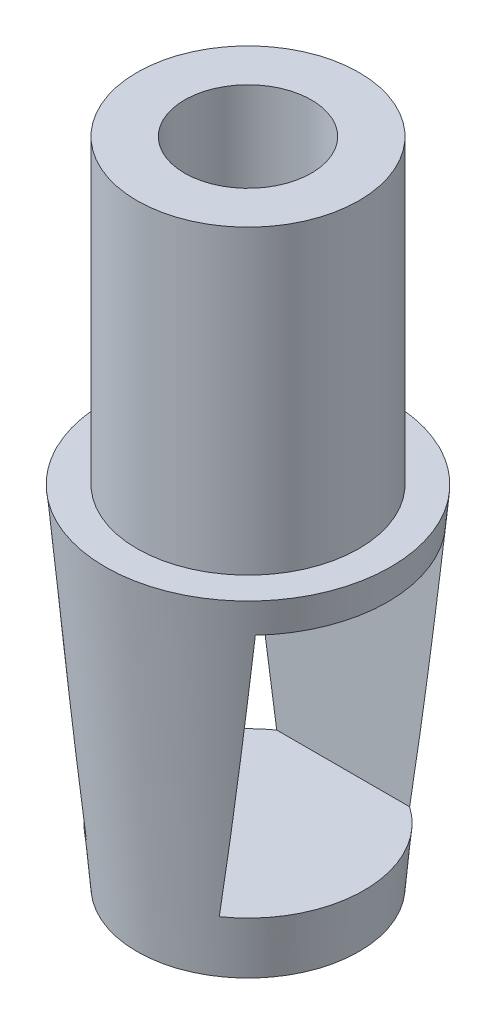
ISO-10303-21;
HEADER;
FILE_DESCRIPTION(('STEP AP214'),'2;1');
FILE_NAME('part.step','',(''),(''),'','','');
FILE_SCHEMA(('AUTOMOTIVE_DESIGN { 1 0 10303 214 1 1 1 1 }'));
ENDSEC;
DATA;
#1=APPLICATION_CONTEXT('core data for automotive mechanical design processes');
#2=APPLICATION_PROTOCOL_DEFINITION('international standard','automotive_design',2000,#1);
#3=PRODUCT_CONTEXT('',#1,'mechanical');
#4=PRODUCT('Part','Part','',(#3));
#5=PRODUCT_RELATED_PRODUCT_CATEGORY('part','',(#4));
#6=PRODUCT_DEFINITION_FORMATION('','',#4);
#7=PRODUCT_DEFINITION_CONTEXT('part definition',#1,'design');
#8=PRODUCT_DEFINITION('design','',#6,#7);
#9=PRODUCT_DEFINITION_SHAPE('','',#8);
#10=(LENGTH_UNIT() NAMED_UNIT(*) SI_UNIT(.MILLI.,.METRE.));
#11=(NAMED_UNIT(*) PLANE_ANGLE_UNIT() SI_UNIT($,.RADIAN.));
#12=(NAMED_UNIT(*) SI_UNIT($,.STERADIAN.) SOLID_ANGLE_UNIT());
#13=UNCERTAINTY_MEASURE_WITH_UNIT(LENGTH_MEASURE(1.E-05),#10,'distance_accuracy_value','');
#14=(GEOMETRIC_REPRESENTATION_CONTEXT(3) GLOBAL_UNCERTAINTY_ASSIGNED_CONTEXT((#13)) GLOBAL_UNIT_ASSIGNED_CONTEXT((#10,
#11,#12)) REPRESENTATION_CONTEXT('',''));
#15=CARTESIAN_POINT('',(0.,0.,0.));
#16=DIRECTION('',(0.,0.,1.));
#17=DIRECTION('',(1.,0.,0.));
#18=AXIS2_PLACEMENT_3D('',#15,#16,#17);
#19=CARTESIAN_POINT('',(0.,13.9245283018868,0.));
#20=DIRECTION('',(0.,1.,0.));
#21=DIRECTION('',(0.,0.,1.));
#22=AXIS2_PLACEMENT_3D('',#19,#20,#21);
#23=CYLINDRICAL_SURFACE('',#22,4.);
#24=CARTESIAN_POINT('',(0.,19.,0.));
#25=DIRECTION('',(0.,1.,0.));
#26=DIRECTION('',(0.,0.,1.));
#27=AXIS2_PLACEMENT_3D('',#24,#25,#26);
#28=CIRCLE('',#27,4.00000000000001);
#29=CARTESIAN_POINT('',(0.,19.,4.00000000000002));
#30=VERTEX_POINT('',#29);
#31=EDGE_CURVE('E151',#30,#30,#28,.T.);
#32=ORIENTED_EDGE('',*,*,#31,.T.);
#33=EDGE_LOOP('',(#32));
#34=FACE_BOUND('',#33,.T.);
#35=CARTESIAN_POINT('',(0.,0.,0.));
#36=DIRECTION('',(0.,1.,0.));
#37=DIRECTION('',(0.,0.,1.));
#38=AXIS2_PLACEMENT_3D('',#35,#36,#37);
#39=CIRCLE('',#38,4.);
#40=CARTESIAN_POINT('',(0.,0.,4.));
#41=VERTEX_POINT('',#40);
#42=EDGE_CURVE('E102',#41,#41,#39,.T.);
#43=ORIENTED_EDGE('',*,*,#42,.F.);
#44=EDGE_LOOP('',(#43));
#45=FACE_BOUND('',#44,.T.);
#46=ADVANCED_FACE('F51',(#34,#45),#23,.F.);
#47=CARTESIAN_POINT('',(0.,0.,0.));
#48=DIRECTION('',(0.,1.,0.));
#49=DIRECTION('',(0.,0.,1.));
#50=AXIS2_PLACEMENT_3D('',#47,#48,#49);
#51=PLANE('',#50);
#52=ORIENTED_EDGE('',*,*,#42,.T.);
#53=EDGE_LOOP('',(#52));
#54=FACE_BOUND('',#53,.T.);
#55=ADVANCED_FACE('F182',(#54),#51,.T.);
#56=CARTESIAN_POINT('',(0.,-22.,0.));
#57=DIRECTION('',(0.,-1.,0.));
#58=DIRECTION('',(0.,0.,-1.));
#59=AXIS2_PLACEMENT_3D('',#56,#57,#58);
#60=PLANE('',#59);
#61=CARTESIAN_POINT('',(0.,-22.,0.));
#62=DIRECTION('',(0.,1.,0.));
#63=DIRECTION('',(0.,0.,1.));
#64=AXIS2_PLACEMENT_3D('',#61,#62,#63);
#65=CIRCLE('',#64,7.);
#66=CARTESIAN_POINT('',(0.,-22.,7.));
#67=VERTEX_POINT('',#66);
#68=EDGE_CURVE('E135',#67,#67,#65,.T.);
#69=ORIENTED_EDGE('',*,*,#68,.F.);
#70=EDGE_LOOP('',(#69));
#71=FACE_BOUND('',#70,.T.);
#72=ADVANCED_FACE('F172',(#71),#60,.T.);
#73=CARTESIAN_POINT('',(0.,0.,0.));
#74=DIRECTION('',(0.,1.,0.));
#75=DIRECTION('',(0.,0.,1.));
#76=AXIS2_PLACEMENT_3D('',#73,#74,#75);
#77=CONICAL_SURFACE('',#76,9.,0.090659887200745);
#78=CARTESIAN_POINT('',(-6.46231018263683,-1.9993,-6.));
#79=CARTESIAN_POINT('',(-6.37935942432775,-2.66794458877008,-6.));
#80=CARTESIAN_POINT('',(-6.2956898472836,-3.3365001406247,-6.));
#81=CARTESIAN_POINT('',(-6.12670920157917,-4.67340597881215,-6.));
#82=CARTESIAN_POINT('',(-6.04139812736397,-5.34175626444256,-6.));
#83=CARTESIAN_POINT('',(-5.78268177169496,-7.34657526324231,-6.));
#84=CARTESIAN_POINT('',(-5.60650862716807,-8.68268841292238,-6.));
#85=CARTESIAN_POINT('',(-5.24443950907989,-11.3540791000082,-6.));
#86=CARTESIAN_POINT('',(-5.05854018503512,-12.6893561869666,-6.));
#87=CARTESIAN_POINT('',(-4.76966273976518,-14.6907979050912,-6.));
#88=CARTESIAN_POINT('',(-4.67170087470982,-15.3576863825078,-6.));
#89=CARTESIAN_POINT('',(-4.47173214536951,-16.6908554924764,-6.));
#90=CARTESIAN_POINT('',(-4.36972529924616,-17.3571361277439,-6.));
#91=CARTESIAN_POINT('',(-4.16077863324696,-18.6888297191254,-6.));
#92=CARTESIAN_POINT('',(-4.05383950945053,-19.3542427841307,-6.00000000000001));
#93=CARTESIAN_POINT('',(-3.83374591720684,-20.6840705091729,-6.00000000000001));
#94=CARTESIAN_POINT('',(-3.72059122717303,-21.3484851327465,-6.00000000000001));
#95=CARTESIAN_POINT('',(-3.48616314363692,-22.6761456180177,-6.00000000000001));
#96=CARTESIAN_POINT('',(-3.36488669116648,-23.3393909416853,-6.00000000000001));
#97=CARTESIAN_POINT('',(-3.11142191435127,-24.6637712448001,-6.00000000000001));
#98=CARTESIAN_POINT('',(-2.97923448923209,-25.3249063935016,-6.00000000000001));
#99=CARTESIAN_POINT('',(-2.76889670162586,-26.314362619077,-6.00000000000001));
#100=CARTESIAN_POINT('',(-2.69673922489046,-26.6439558082014,-6.00000000000001));
#101=CARTESIAN_POINT('',(-2.5473509679028,-27.3020324078138,-6.00000000000001));
#102=CARTESIAN_POINT('',(-2.47011970150373,-27.6305157087778,-6.00000000000001));
#103=CARTESIAN_POINT('',(-2.30917395247025,-28.2855675851889,-6.00000000000001));
#104=CARTESIAN_POINT('',(-2.22546568330613,-28.6121376801916,-6.00000000000001));
#105=CARTESIAN_POINT('',(-2.0492138877789,-29.2628497709145,-6.00000000000001));
#106=CARTESIAN_POINT('',(-1.95667246417216,-29.5869923248007,-6.00000000000001));
#107=CARTESIAN_POINT('',(-1.80807051846129,-30.070353885402,-6.00000000000001));
#108=CARTESIAN_POINT('',(-1.75688126151749,-30.231066156889,-6.00000000000001));
#109=CARTESIAN_POINT('',(-1.65034836403102,-30.5511694824512,-6.00000000000001));
#110=CARTESIAN_POINT('',(-1.59500348407092,-30.7105601264844,-6.00000000000001));
#111=CARTESIAN_POINT('',(-1.47876387206491,-31.0278769745349,-6.00000000000001));
#112=CARTESIAN_POINT('',(-1.41785300198781,-31.1857973569419,-6.00000000000001));
#113=CARTESIAN_POINT('',(-1.28865528628903,-31.498469484442,-6.00000000000001));
#114=CARTESIAN_POINT('',(-1.22037381475268,-31.653223441619,-6.00000000000001));
#115=CARTESIAN_POINT('',(-1.07240918514391,-31.9589830848423,-6.00000000000001));
#116=CARTESIAN_POINT('',(-0.992639494830994,-32.1099490682026,-6.00000000000001));
#117=CARTESIAN_POINT('',(-0.859558877292963,-32.3278581823448,-6.00000000000001));
#118=CARTESIAN_POINT('',(-0.813073236470432,-32.3989300720203,-6.00000000000001));
#119=CARTESIAN_POINT('',(-0.713964103510855,-32.5366005069512,-6.00000000000001));
#120=CARTESIAN_POINT('',(-0.661353530103351,-32.6032080168615,-6.00000000000001));
#121=CARTESIAN_POINT('',(-0.565355546696097,-32.7090258150407,-6.00000000000001));
#122=CARTESIAN_POINT('',(-0.524247515228568,-32.7502787028125,-6.00000000000001));
#123=CARTESIAN_POINT('',(-0.436899118708625,-32.8269885618878,-6.00000000000001));
#124=CARTESIAN_POINT('',(-0.390671820848004,-32.8624597436131,-6.00000000000001));
#125=CARTESIAN_POINT('',(-0.31043433962961,-32.9125928113377,-6.00000000000001));
#126=CARTESIAN_POINT('',(-0.278226398018191,-32.9300996001808,-6.00000000000001));
#127=CARTESIAN_POINT('',(-0.211503161510035,-32.9600217424756,-6.00000000000001));
#128=CARTESIAN_POINT('',(-0.176990590459972,-32.9724429868695,-6.00000000000001));
#129=CARTESIAN_POINT('',(-0.105778851194416,-32.9909144503191,-6.00000000000001));
#130=CARTESIAN_POINT('',(-0.069057824202828,-32.9968834993743,-6.00000000000001));
#131=CARTESIAN_POINT('',(0.00482553061560141,-33.0012255317401,-6.00000000000001));
#132=CARTESIAN_POINT('',(0.0419874812307327,-32.9996045982406,-6.00000000000001));
#133=CARTESIAN_POINT('',(0.109633461671014,-32.9898722961471,-6.00000000000001));
#134=CARTESIAN_POINT('',(0.140274071358525,-32.9827847338061,-6.00000000000001));
#135=CARTESIAN_POINT('',(0.200142228043524,-32.9641127888135,-6.00000000000001));
#136=CARTESIAN_POINT('',(0.229368717929532,-32.9525250988048,-6.00000000000001));
#137=CARTESIAN_POINT('',(0.303930090144421,-32.9173324737707,-6.00000000000001));
#138=CARTESIAN_POINT('',(0.347846552458206,-32.8907516985753,-6.00000000000001));
#139=CARTESIAN_POINT('',(0.431225808809345,-32.8313537200715,-6.00000000000001));
#140=CARTESIAN_POINT('',(0.470673554976685,-32.7985163889686,-6.00000000000001));
#141=CARTESIAN_POINT('',(0.556050336859071,-32.7192555041606,-6.00000000000001));
#142=CARTESIAN_POINT('',(0.600793917178124,-32.6715745480462,-6.00000000000001));
#143=CARTESIAN_POINT('',(0.685584079021494,-32.5721564008456,-6.00000000000001));
#144=CARTESIAN_POINT('',(0.725621156590544,-32.5204113427441,-6.00000000000001));
#145=CARTESIAN_POINT('',(0.802222367865767,-32.4139995538968,-6.00000000000001));
#146=CARTESIAN_POINT('',(0.838765828815574,-32.3593181032039,-6.00000000000001));
#147=CARTESIAN_POINT('',(0.908869890617169,-32.2481712297426,-6.00000000000001));
#148=CARTESIAN_POINT('',(0.942433338796798,-32.1917075813083,-6.00000000000001));
#149=CARTESIAN_POINT('',(1.03831748595918,-32.0226026253203,-6.00000000000001));
#150=CARTESIAN_POINT('',(1.09730584512016,-31.9080782417154,-6.00000000000001));
#151=CARTESIAN_POINT('',(1.20905966879547,-31.6760076963523,-6.00000000000001));
#152=CARTESIAN_POINT('',(1.26182055544746,-31.5584593880455,-6.00000000000001));
#153=CARTESIAN_POINT('',(1.36280266641755,-31.321126564471,-6.00000000000001));
#154=CARTESIAN_POINT('',(1.41101336583855,-31.2013375972715,-6.00000000000001));
#155=CARTESIAN_POINT('',(1.50381682889486,-30.9603598495348,-6.00000000000001));
#156=CARTESIAN_POINT('',(1.54840906541337,-30.8391708679786,-6.00000000000001));
#157=CARTESIAN_POINT('',(1.6780205270827,-30.4736923122705,-6.00000000000001));
#158=CARTESIAN_POINT('',(1.75871836413023,-30.2278732224732,-6.00000000000001));
#159=CARTESIAN_POINT('',(1.91210500462234,-29.7342036292017,-6.00000000000001));
#160=CARTESIAN_POINT('',(1.98480560710962,-29.4863567142038,-6.00000000000001));
#161=CARTESIAN_POINT('',(2.1235903813798,-28.9917849034606,-6.00000000000001));
#162=CARTESIAN_POINT('',(2.18973891630306,-28.7450779840567,-6.00000000000001));
#163=CARTESIAN_POINT('',(2.31759480295047,-28.2505145482136,-6.00000000000001));
#164=CARTESIAN_POINT('',(2.37930198063768,-28.0026579871296,-6.00000000000001));
#165=CARTESIAN_POINT('',(2.55914895538237,-27.2577185010068,-6.00000000000001));
#166=CARTESIAN_POINT('',(2.67198916463082,-26.759357882274,-6.00000000000001));
#167=CARTESIAN_POINT('',(2.88807394189341,-25.7599542695744,-6.00000000000001));
#168=CARTESIAN_POINT('',(2.99130652429281,-25.2589087284481,-6.00000000000001));
#169=CARTESIAN_POINT('',(3.19050477530022,-24.2554364124618,-6.00000000000001));
#170=CARTESIAN_POINT('',(3.28647121345072,-23.7530097897263,-6.00000000000001));
#171=CARTESIAN_POINT('',(3.47259526816564,-22.7482029879045,-6.00000000000001));
#172=CARTESIAN_POINT('',(3.56276490864165,-22.2458250230366,-6.00000000000001));
#173=CARTESIAN_POINT('',(3.73862472614479,-21.2402754073415,-6.00000000000001));
#174=CARTESIAN_POINT('',(3.82431478732155,-20.7371037363338,-6.00000000000001));
#175=CARTESIAN_POINT('',(4.07582167152908,-19.2272660316134,-6.00000000000001));
#176=CARTESIAN_POINT('',(4.23618162664312,-18.2196908612811,-6.));
#177=CARTESIAN_POINT('',(4.48869818996592,-16.5789919574691,-6.));
#178=CARTESIAN_POINT('',(4.58398901134262,-15.9463434644319,-6.));
#179=CARTESIAN_POINT('',(4.77115311878706,-14.6805380340131,-6.));
#180=CARTESIAN_POINT('',(4.86302639215382,-14.0473810947508,-6.));
#181=CARTESIAN_POINT('',(5.13439436191741,-12.1470254580383,-6.));
#182=CARTESIAN_POINT('',(5.3095958128726,-10.8792142272384,-6.));
#183=CARTESIAN_POINT('',(5.65144991125337,-8.34302619440632,-6.));
#184=CARTESIAN_POINT('',(5.81810635794707,-7.07464990113139,-6.));
#185=CARTESIAN_POINT('',(6.06314401760262,-5.17162016457147,-6.));
#186=CARTESIAN_POINT('',(6.14398847052803,-4.53728248587954,-6.));
#187=CARTESIAN_POINT('',(6.30420816637652,-3.26842332974251,-6.));
#188=CARTESIAN_POINT('',(6.3835834133723,-2.63390185281186,-6.));
#189=CARTESIAN_POINT('',(6.46231018263683,-1.9993,-6.));
#190=B_SPLINE_CURVE_WITH_KNOTS('',3,(#78,#79,#80,#81,#82,#83,#84,#85,#86,#87,#88,#89,#90,#91,
#92,#93,#94,#95,#96,#97,#98,#99,#100,#101,#102,#103,#104,#105,#106,#107,#108,#109,#110,#111,
#112,#113,#114,#115,#116,#117,#118,#119,#120,#121,#122,#123,#124,#125,#126,#127,#128,#129,#130,
#131,#132,#133,#134,#135,#136,#137,#138,#139,#140,#141,#142,#143,#144,#145,#146,#147,#148,#149,
#150,#151,#152,#153,#154,#155,#156,#157,#158,#159,#160,#161,#162,#163,#164,#165,#166,#167,#168,
#169,#170,#171,#172,#173,#174,#175,#176,#177,#178,#179,#180,#181,#182,#183,#184,#185,#186,#187,
#188,#189),.UNSPECIFIED.,.F.,.F.,(4,2,2,2,2,2,2,2,2,2,2,2,2,2,2,2,2,2,2,2,2,2,2,2,2,2,2,2,2,2,2,
2,2,2,2,2,2,2,2,2,2,2,2,2,2,2,2,2,2,2,2,2,2,2,2,4),(0.,2.02131050288426,4.04262784720109,
8.08563646390937,12.1300471095781,14.1521728428488,16.1742894979873,18.1961216451333,
20.2180259179578,22.2406960477868,24.2631996457909,25.2753693035684,26.2876360845584,
27.2989435461013,28.310010860739,28.8159711691378,29.3220829845816,29.8297118336899,
30.3369730268251,30.8482769981843,31.1028558113209,31.3569070756199,31.531311614382,
31.7052808138154,31.8149284503739,31.9244487125761,32.0353312791708,32.1461249912523,
32.2400810724824,32.3341063375694,32.4872161025373,32.6408270137654,32.8365247747647,
33.0326111609349,33.2297940659921,33.4267864933289,33.81293153773,34.1993586953489,
34.5866588369477,34.974015297287,35.7499650703679,36.5247542092434,37.2909620464053,
38.0571998914987,39.5899618081632,41.1246109252632,42.6590972828087,44.1902905939014,
45.7215234849721,48.782201386091,50.7015491660104,52.6209040782837,56.4604401095523,
60.2982539387511,62.2166583723107,64.1350574871863),.UNSPECIFIED.);
#191=CARTESIAN_POINT('',(-6.46222334638106,-2.00000000000001,-6.));
#192=VERTEX_POINT('',#191);
#193=CARTESIAN_POINT('',(-4.1899624251259,-18.5,-6.));
#194=VERTEX_POINT('',#193);
#195=EDGE_CURVE('E11',#192,#194,#190,.T.);
#196=ORIENTED_EDGE('',*,*,#195,.F.);
#197=CARTESIAN_POINT('',(0.,-2.00000000000001,0.));
#198=DIRECTION('',(0.,1.,0.));
#199=DIRECTION('',(0.,0.,1.));
#200=AXIS2_PLACEMENT_3D('',#197,#198,#199);
#201=CIRCLE('',#200,8.81818181818182);
#202=CARTESIAN_POINT('',(-6.46222334638106,-2.00000000000001,6.));
#203=VERTEX_POINT('',#202);
#204=EDGE_CURVE('E104',#203,#192,#201,.F.);
#205=ORIENTED_EDGE('',*,*,#204,.F.);
#206=CARTESIAN_POINT('',(6.46231018263683,-1.9993,6.));
#207=CARTESIAN_POINT('',(6.37935942432775,-2.66794458877008,6.));
#208=CARTESIAN_POINT('',(6.2956898472836,-3.3365001406247,6.));
#209=CARTESIAN_POINT('',(6.12670920157917,-4.67340597881214,6.));
#210=CARTESIAN_POINT('',(6.04139812736397,-5.34175626444256,6.));
#211=CARTESIAN_POINT('',(5.78268177169497,-7.3465752632423,6.));
#212=CARTESIAN_POINT('',(5.60650862716807,-8.68268841292237,6.));
#213=CARTESIAN_POINT('',(5.24443950907989,-11.3540791000082,6.));
#214=CARTESIAN_POINT('',(5.05854018503512,-12.6893561869666,6.));
#215=CARTESIAN_POINT('',(4.76966273976518,-14.6907979050912,6.));
#216=CARTESIAN_POINT('',(4.67170087470982,-15.3576863825078,6.));
#217=CARTESIAN_POINT('',(4.47173214536951,-16.6908554924764,6.));
#218=CARTESIAN_POINT('',(4.36972529924616,-17.3571361277439,6.));
#219=CARTESIAN_POINT('',(4.16077863324696,-18.6888297191254,6.));
#220=CARTESIAN_POINT('',(4.05383950945053,-19.3542427841307,6.));
#221=CARTESIAN_POINT('',(3.83374591720684,-20.6840705091729,6.));
#222=CARTESIAN_POINT('',(3.72059122717304,-21.3484851327465,6.));
#223=CARTESIAN_POINT('',(3.48616314363692,-22.6761456180177,6.));
#224=CARTESIAN_POINT('',(3.36488669116649,-23.3393909416853,6.));
#225=CARTESIAN_POINT('',(3.11142191435127,-24.6637712448001,6.));
#226=CARTESIAN_POINT('',(2.97923448923209,-25.3249063935016,6.));
#227=CARTESIAN_POINT('',(2.76889670162586,-26.314362619077,6.));
#228=CARTESIAN_POINT('',(2.69673922489046,-26.6439558082014,6.));
#229=CARTESIAN_POINT('',(2.54735096790281,-27.3020324078138,6.));
#230=CARTESIAN_POINT('',(2.47011970150374,-27.6305157087778,6.));
#231=CARTESIAN_POINT('',(2.30917395247025,-28.2855675851889,6.));
#232=CARTESIAN_POINT('',(2.22546568330613,-28.6121376801917,6.));
#233=CARTESIAN_POINT('',(2.04921388777891,-29.2628497709145,6.));
#234=CARTESIAN_POINT('',(1.95667246417216,-29.5869923248007,6.));
#235=CARTESIAN_POINT('',(1.8080705184613,-30.070353885402,6.));
#236=CARTESIAN_POINT('',(1.7568812615175,-30.231066156889,6.));
#237=CARTESIAN_POINT('',(1.65034836403103,-30.5511694824512,6.));
#238=CARTESIAN_POINT('',(1.59500348407093,-30.7105601264844,6.));
#239=CARTESIAN_POINT('',(1.47876387206492,-31.027876974535,6.));
#240=CARTESIAN_POINT('',(1.41785300198782,-31.1857973569419,6.));
#241=CARTESIAN_POINT('',(1.28865528628904,-31.4984694844421,6.));
#242=CARTESIAN_POINT('',(1.2203738147527,-31.653223441619,6.));
#243=CARTESIAN_POINT('',(1.07240918514393,-31.9589830848424,6.));
#244=CARTESIAN_POINT('',(0.992639494831005,-32.1099490682026,6.));
#245=CARTESIAN_POINT('',(0.85955887729297,-32.3278581823448,6.));
#246=CARTESIAN_POINT('',(0.813073236470437,-32.3989300720204,6.));
#247=CARTESIAN_POINT('',(0.713964103510863,-32.5366005069512,6.));
#248=CARTESIAN_POINT('',(0.661353530103362,-32.6032080168615,6.));
#249=CARTESIAN_POINT('',(0.565355546696106,-32.7090258150407,6.));
#250=CARTESIAN_POINT('',(0.524247515228571,-32.7502787028125,6.));
#251=CARTESIAN_POINT('',(0.436899118708627,-32.8269885618878,6.));
#252=CARTESIAN_POINT('',(0.39067182084801,-32.8624597436131,6.));
#253=CARTESIAN_POINT('',(0.31043433962962,-32.9125928113377,6.));
#254=CARTESIAN_POINT('',(0.278226398018201,-32.9300996001808,6.));
#255=CARTESIAN_POINT('',(0.211503161510044,-32.9600217424757,6.));
#256=CARTESIAN_POINT('',(0.17699059045998,-32.9724429868695,6.));
#257=CARTESIAN_POINT('',(0.105778851194425,-32.9909144503191,6.));
#258=CARTESIAN_POINT('',(0.0690578242028393,-32.9968834993743,6.));
#259=CARTESIAN_POINT('',(-0.00482553061558923,-33.0012255317401,6.));
#260=CARTESIAN_POINT('',(-0.0419874812307219,-32.9996045982406,6.));
#261=CARTESIAN_POINT('',(-0.109633461671005,-32.9898722961471,6.));
#262=CARTESIAN_POINT('',(-0.140274071358517,-32.9827847338061,6.));
#263=CARTESIAN_POINT('',(-0.200142228043517,-32.9641127888136,6.));
#264=CARTESIAN_POINT('',(-0.229368717929525,-32.9525250988049,6.));
#265=CARTESIAN_POINT('',(-0.303930090144412,-32.9173324737707,6.));
#266=CARTESIAN_POINT('',(-0.347846552458195,-32.8907516985753,6.));
#267=CARTESIAN_POINT('',(-0.431225808809335,-32.8313537200715,6.));
#268=CARTESIAN_POINT('',(-0.470673554976679,-32.7985163889686,6.));
#269=CARTESIAN_POINT('',(-0.556050336859066,-32.7192555041607,6.));
#270=CARTESIAN_POINT('',(-0.600793917178116,-32.6715745480462,6.));
#271=CARTESIAN_POINT('',(-0.685584079021484,-32.5721564008456,6.));
#272=CARTESIAN_POINT('',(-0.725621156590536,-32.5204113427442,6.));
#273=CARTESIAN_POINT('',(-0.802222367865759,-32.4139995538968,6.));
#274=CARTESIAN_POINT('',(-0.838765828815563,-32.3593181032039,6.));
#275=CARTESIAN_POINT('',(-0.908869890617163,-32.2481712297426,6.));
#276=CARTESIAN_POINT('',(-0.942433338796799,-32.1917075813083,6.));
#277=CARTESIAN_POINT('',(-1.03831748595919,-32.0226026253204,6.));
#278=CARTESIAN_POINT('',(-1.09730584512017,-31.9080782417155,6.));
#279=CARTESIAN_POINT('',(-1.20905966879546,-31.6760076963523,6.));
#280=CARTESIAN_POINT('',(-1.26182055544747,-31.5584593880456,6.));
#281=CARTESIAN_POINT('',(-1.36280266641755,-31.321126564471,6.));
#282=CARTESIAN_POINT('',(-1.41101336583855,-31.2013375972716,6.));
#283=CARTESIAN_POINT('',(-1.50381682889486,-30.9603598495349,6.));
#284=CARTESIAN_POINT('',(-1.54840906541337,-30.8391708679786,6.));
#285=CARTESIAN_POINT('',(-1.6780205270827,-30.4736923122706,6.));
#286=CARTESIAN_POINT('',(-1.75871836413024,-30.2278732224732,6.));
#287=CARTESIAN_POINT('',(-1.91210500462234,-29.7342036292017,6.));
#288=CARTESIAN_POINT('',(-1.98480560710962,-29.4863567142038,6.));
#289=CARTESIAN_POINT('',(-2.12359038137981,-28.9917849034606,6.));
#290=CARTESIAN_POINT('',(-2.18973891630306,-28.7450779840567,6.));
#291=CARTESIAN_POINT('',(-2.31759480295047,-28.2505145482136,6.));
#292=CARTESIAN_POINT('',(-2.37930198063769,-28.0026579871296,6.));
#293=CARTESIAN_POINT('',(-2.55914895538238,-27.2577185010068,6.));
#294=CARTESIAN_POINT('',(-2.67198916463083,-26.759357882274,6.));
#295=CARTESIAN_POINT('',(-2.88807394189342,-25.7599542695744,6.));
#296=CARTESIAN_POINT('',(-2.99130652429282,-25.2589087284481,6.));
#297=CARTESIAN_POINT('',(-3.19050477530023,-24.2554364124618,6.));
#298=CARTESIAN_POINT('',(-3.28647121345073,-23.7530097897263,6.));
#299=CARTESIAN_POINT('',(-3.47259526816566,-22.7482029879044,6.));
#300=CARTESIAN_POINT('',(-3.56276490864166,-22.2458250230366,6.));
#301=CARTESIAN_POINT('',(-3.7386247261448,-21.2402754073414,6.));
#302=CARTESIAN_POINT('',(-3.82431478732157,-20.7371037363337,6.));
#303=CARTESIAN_POINT('',(-4.0758216715291,-19.2272660316133,6.));
#304=CARTESIAN_POINT('',(-4.23618162664313,-18.219690861281,6.));
#305=CARTESIAN_POINT('',(-4.48869818996594,-16.578991957469,6.));
#306=CARTESIAN_POINT('',(-4.58398901134264,-15.9463434644318,6.));
#307=CARTESIAN_POINT('',(-4.77115311878708,-14.680538034013,6.));
#308=CARTESIAN_POINT('',(-4.86302639215384,-14.0473810947507,6.));
#309=CARTESIAN_POINT('',(-5.13439436191742,-12.1470254580382,6.));
#310=CARTESIAN_POINT('',(-5.30959581287261,-10.8792142272383,6.));
#311=CARTESIAN_POINT('',(-5.65144991125338,-8.34302619440629,6.));
#312=CARTESIAN_POINT('',(-5.81810635794708,-7.07464990113137,6.));
#313=CARTESIAN_POINT('',(-6.06314401760263,-5.17162016457146,6.));
#314=CARTESIAN_POINT('',(-6.14398847052803,-4.53728248587953,6.));
#315=CARTESIAN_POINT('',(-6.30420816637652,-3.26842332974251,6.));
#316=CARTESIAN_POINT('',(-6.3835834133723,-2.63390185281186,6.));
#317=CARTESIAN_POINT('',(-6.46231018263683,-1.9993,6.));
#318=B_SPLINE_CURVE_WITH_KNOTS('',3,(#206,#207,#208,#209,#210,#211,#212,#213,#214,#215,#216,
#217,#218,#219,#220,#221,#222,#223,#224,#225,#226,#227,#228,#229,#230,#231,#232,#233,#234,#235,
#236,#237,#238,#239,#240,#241,#242,#243,#244,#245,#246,#247,#248,#249,#250,#251,#252,#253,#254,
#255,#256,#257,#258,#259,#260,#261,#262,#263,#264,#265,#266,#267,#268,#269,#270,#271,#272,#273,
#274,#275,#276,#277,#278,#279,#280,#281,#282,#283,#284,#285,#286,#287,#288,#289,#290,#291,#292,
#293,#294,#295,#296,#297,#298,#299,#300,#301,#302,#303,#304,#305,#306,#307,#308,#309,#310,#311,
#312,#313,#314,#315,#316,#317),.UNSPECIFIED.,.F.,.F.,(4,2,2,2,2,2,2,2,2,2,2,2,2,2,2,2,2,2,2,2,2,
2,2,2,2,2,2,2,2,2,2,2,2,2,2,2,2,2,2,2,2,2,2,2,2,2,2,2,2,2,2,2,2,2,2,4),(0.,2.02131050288425,
4.04262784720108,8.08563646390936,12.1300471095781,14.1521728428487,16.1742894979873,
18.1961216451333,20.2180259179578,22.2406960477868,24.2631996457909,25.2753693035684,
26.2876360845584,27.2989435461013,28.310010860739,28.8159711691378,29.3220829845816,
29.8297118336899,30.3369730268251,30.8482769981843,31.1028558113209,31.3569070756199,
31.531311614382,31.7052808138154,31.8149284503739,31.9244487125762,32.0353312791708,
32.1461249912523,32.2400810724824,32.3341063375695,32.4872161025373,32.6408270137655,
32.8365247747647,33.0326111609349,33.2297940659921,33.4267864933289,33.81293153773,
34.1993586953489,34.5866588369477,34.974015297287,35.7499650703679,36.5247542092434,
37.2909620464053,38.0571998914987,39.5899618081633,41.1246109252632,42.6590972828088,
44.1902905939015,45.7215234849722,48.7822013860911,50.7015491660105,52.6209040782838,
56.4604401095523,60.2982539387512,62.2166583723108,64.1350574871863),.UNSPECIFIED.);
#319=CARTESIAN_POINT('',(-4.18996242512592,-18.5,6.));
#320=VERTEX_POINT('',#319);
#321=EDGE_CURVE('E110',#320,#203,#318,.T.);
#322=ORIENTED_EDGE('',*,*,#321,.F.);
#323=CARTESIAN_POINT('',(0.,-18.5,0.));
#324=DIRECTION('',(0.,-1.,0.));
#325=DIRECTION('',(0.,0.,-1.));
#326=AXIS2_PLACEMENT_3D('',#323,#324,#325);
#327=CIRCLE('',#326,7.31818181818182);
#328=EDGE_CURVE('E66',#194,#320,#327,.F.);
#329=ORIENTED_EDGE('',*,*,#328,.F.);
#330=EDGE_LOOP('',(#196,#205,#322,#329));
#331=FACE_BOUND('',#330,.T.);
#332=CARTESIAN_POINT('',(4.1899624251259,-18.5,-6.));
#333=VERTEX_POINT('',#332);
#334=CARTESIAN_POINT('',(6.46222334638106,-2.00000000000001,-6.));
#335=VERTEX_POINT('',#334);
#336=EDGE_CURVE('E54',#333,#335,#190,.T.);
#337=ORIENTED_EDGE('',*,*,#336,.F.);
#338=CARTESIAN_POINT('',(4.18996242512592,-18.5,6.));
#339=VERTEX_POINT('',#338);
#340=EDGE_CURVE('E118',#339,#333,#327,.F.);
#341=ORIENTED_EDGE('',*,*,#340,.F.);
#342=CARTESIAN_POINT('',(6.46222334638106,-2.00000000000001,6.));
#343=VERTEX_POINT('',#342);
#344=EDGE_CURVE('E101',#343,#339,#318,.T.);
#345=ORIENTED_EDGE('',*,*,#344,.F.);
#346=EDGE_CURVE('E95',#335,#343,#201,.F.);
#347=ORIENTED_EDGE('',*,*,#346,.F.);
#348=EDGE_LOOP('',(#337,#341,#345,#347));
#349=FACE_BOUND('',#348,.T.);
#350=ORIENTED_EDGE('',*,*,#68,.T.);
#351=EDGE_LOOP('',(#350));
#352=FACE_BOUND('',#351,.T.);
#353=CARTESIAN_POINT('',(0.,0.,0.));
#354=DIRECTION('',(0.,1.,0.));
#355=DIRECTION('',(0.,0.,1.));
#356=AXIS2_PLACEMENT_3D('',#353,#354,#355);
#357=CIRCLE('',#356,9.);
#358=CARTESIAN_POINT('',(0.,0.,9.00000000000001));
#359=VERTEX_POINT('',#358);
#360=EDGE_CURVE('E139',#359,#359,#357,.T.);
#361=ORIENTED_EDGE('',*,*,#360,.F.);
#362=EDGE_LOOP('',(#361));
#363=FACE_BOUND('',#362,.T.);
#364=ADVANCED_FACE('F116',(#331,#349,#352,#363),#77,.T.);
#365=CARTESIAN_POINT('',(0.,0.,0.));
#366=DIRECTION('',(0.,1.,0.));
#367=DIRECTION('',(0.,0.,1.));
#368=AXIS2_PLACEMENT_3D('',#365,#366,#367);
#369=PLANE('',#368);
#370=ORIENTED_EDGE('',*,*,#360,.T.);
#371=EDGE_LOOP('',(#370));
#372=FACE_BOUND('',#371,.T.);
#373=CARTESIAN_POINT('',(0.,0.,0.));
#374=DIRECTION('',(0.,1.,0.));
#375=DIRECTION('',(0.,0.,1.));
#376=AXIS2_PLACEMENT_3D('',#373,#374,#375);
#377=CIRCLE('',#376,7.);
#378=CARTESIAN_POINT('',(0.,0.,7.00000000000001));
#379=VERTEX_POINT('',#378);
#380=EDGE_CURVE('E143',#379,#379,#377,.T.);
#381=ORIENTED_EDGE('',*,*,#380,.F.);
#382=EDGE_LOOP('',(#381));
#383=FACE_BOUND('',#382,.T.);
#384=ADVANCED_FACE('F171',(#372,#383),#369,.T.);
#385=CARTESIAN_POINT('',(0.,13.9245283018868,0.));
#386=DIRECTION('',(0.,1.,0.));
#387=DIRECTION('',(0.,0.,1.));
#388=AXIS2_PLACEMENT_3D('',#385,#386,#387);
#389=CYLINDRICAL_SURFACE('',#388,7.00000000000001);
#390=ORIENTED_EDGE('',*,*,#380,.T.);
#391=EDGE_LOOP('',(#390));
#392=FACE_BOUND('',#391,.T.);
#393=CARTESIAN_POINT('',(0.,19.,0.));
#394=DIRECTION('',(0.,1.,0.));
#395=DIRECTION('',(0.,0.,1.));
#396=AXIS2_PLACEMENT_3D('',#393,#394,#395);
#397=CIRCLE('',#396,7.00000000000001);
#398=CARTESIAN_POINT('',(0.,19.,7.00000000000001));
#399=VERTEX_POINT('',#398);
#400=EDGE_CURVE('E147',#399,#399,#397,.T.);
#401=ORIENTED_EDGE('',*,*,#400,.F.);
#402=EDGE_LOOP('',(#401));
#403=FACE_BOUND('',#402,.T.);
#404=ADVANCED_FACE('F178',(#392,#403),#389,.T.);
#405=CARTESIAN_POINT('',(0.,19.,0.));
#406=DIRECTION('',(0.,1.,0.));
#407=DIRECTION('',(0.,0.,1.));
#408=AXIS2_PLACEMENT_3D('',#405,#406,#407);
#409=PLANE('',#408);
#410=ORIENTED_EDGE('',*,*,#400,.T.);
#411=EDGE_LOOP('',(#410));
#412=FACE_BOUND('',#411,.T.);
#413=ORIENTED_EDGE('',*,*,#31,.F.);
#414=EDGE_LOOP('',(#413));
#415=FACE_BOUND('',#414,.T.);
#416=ADVANCED_FACE('F196',(#412,#415),#409,.T.);
#417=CARTESIAN_POINT('',(-9.,-2.00000000000001,-6.));
#418=DIRECTION('',(0.,0.,-1.));
#419=DIRECTION('',(0.,1.,0.));
#420=AXIS2_PLACEMENT_3D('',#417,#418,#419);
#421=PLANE('',#420);
#422=ORIENTED_EDGE('',*,*,#195,.T.);
#423=DIRECTION('',(1.,0.,0.));
#424=VECTOR('',#423,1.);
#425=CARTESIAN_POINT('',(-9.,-18.5,-6.));
#426=LINE('',#425,#424);
#427=EDGE_CURVE('E155',#194,#333,#426,.T.);
#428=ORIENTED_EDGE('',*,*,#427,.T.);
#429=ORIENTED_EDGE('',*,*,#336,.T.);
#430=DIRECTION('',(1.,0.,0.));
#431=VECTOR('',#430,1.);
#432=CARTESIAN_POINT('',(-9.,-2.00000000000001,-6.));
#433=LINE('',#432,#431);
#434=EDGE_CURVE('E78',#192,#335,#433,.T.);
#435=ORIENTED_EDGE('',*,*,#434,.F.);
#436=EDGE_LOOP('',(#422,#428,#429,#435));
#437=FACE_BOUND('',#436,.T.);
#438=ADVANCED_FACE('F164',(#437),#421,.F.);
#439=CARTESIAN_POINT('',(-9.,-18.5,6.));
#440=DIRECTION('',(0.,-1.,0.));
#441=DIRECTION('',(0.,0.,-1.));
#442=AXIS2_PLACEMENT_3D('',#439,#440,#441);
#443=PLANE('',#442);
#444=ORIENTED_EDGE('',*,*,#328,.T.);
#445=DIRECTION('',(1.,0.,0.));
#446=VECTOR('',#445,1.);
#447=CARTESIAN_POINT('',(-9.,-18.5,6.));
#448=LINE('',#447,#446);
#449=EDGE_CURVE('E113',#320,#339,#448,.T.);
#450=ORIENTED_EDGE('',*,*,#449,.T.);
#451=ORIENTED_EDGE('',*,*,#340,.T.);
#452=ORIENTED_EDGE('',*,*,#427,.F.);
#453=EDGE_LOOP('',(#444,#450,#451,#452));
#454=FACE_BOUND('',#453,.T.);
#455=ADVANCED_FACE('F168',(#454),#443,.F.);
#456=CARTESIAN_POINT('',(-9.,-2.00000000000001,6.));
#457=DIRECTION('',(0.,0.,1.));
#458=DIRECTION('',(0.,-1.,0.));
#459=AXIS2_PLACEMENT_3D('',#456,#457,#458);
#460=PLANE('',#459);
#461=ORIENTED_EDGE('',*,*,#344,.T.);
#462=ORIENTED_EDGE('',*,*,#449,.F.);
#463=ORIENTED_EDGE('',*,*,#321,.T.);
#464=DIRECTION('',(1.,0.,0.));
#465=VECTOR('',#464,1.);
#466=CARTESIAN_POINT('',(-9.,-2.00000000000001,6.));
#467=LINE('',#466,#465);
#468=EDGE_CURVE('E73',#203,#343,#467,.T.);
#469=ORIENTED_EDGE('',*,*,#468,.T.);
#470=EDGE_LOOP('',(#461,#462,#463,#469));
#471=FACE_BOUND('',#470,.T.);
#472=ADVANCED_FACE('F106',(#471),#460,.F.);
#473=CARTESIAN_POINT('',(-9.,-2.00000000000001,6.));
#474=DIRECTION('',(0.,1.,0.));
#475=DIRECTION('',(0.,0.,1.));
#476=AXIS2_PLACEMENT_3D('',#473,#474,#475);
#477=PLANE('',#476);
#478=ORIENTED_EDGE('',*,*,#204,.T.);
#479=ORIENTED_EDGE('',*,*,#434,.T.);
#480=ORIENTED_EDGE('',*,*,#346,.T.);
#481=ORIENTED_EDGE('',*,*,#468,.F.);
#482=EDGE_LOOP('',(#478,#479,#480,#481));
#483=FACE_BOUND('',#482,.T.);
#484=ADVANCED_FACE('F96',(#483),#477,.F.);
#485=CLOSED_SHELL('',(#46,#55,#72,#364,#384,#404,#416,#438,#455,#472,#484));
#486=MANIFOLD_SOLID_BREP('B2',#485);
#487=ADVANCED_BREP_SHAPE_REPRESENTATION('',(#18,#486),#14);
#488=SHAPE_DEFINITION_REPRESENTATION(#9,#487);
ENDSEC;
END-ISO-10303-21;
